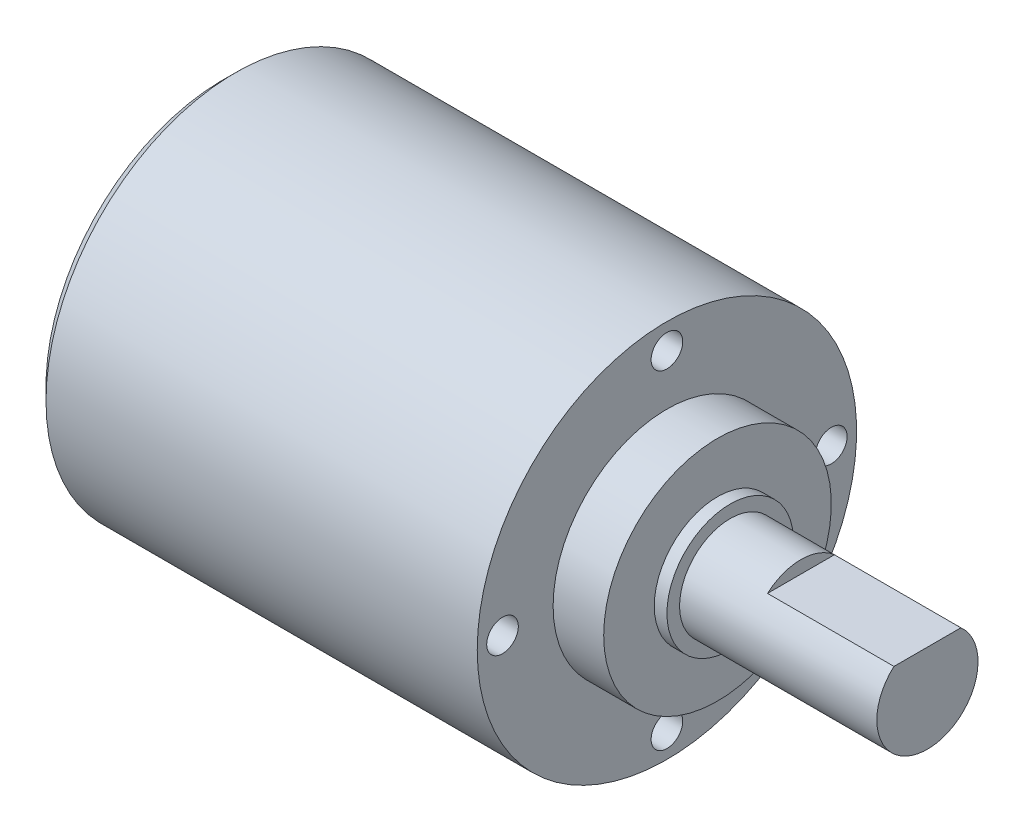
ISO-10303-21;
HEADER;
FILE_DESCRIPTION(('STEP AP214'),'2;1');
FILE_NAME('part.step','',(''),(''),'','','');
FILE_SCHEMA(('AUTOMOTIVE_DESIGN { 1 0 10303 214 1 1 1 1 }'));
ENDSEC;
DATA;
#1=APPLICATION_CONTEXT('core data for automotive mechanical design processes');
#2=APPLICATION_PROTOCOL_DEFINITION('international standard','automotive_design',2000,#1);
#3=PRODUCT_CONTEXT('',#1,'mechanical');
#4=PRODUCT('Part','Part','',(#3));
#5=PRODUCT_RELATED_PRODUCT_CATEGORY('part','',(#4));
#6=PRODUCT_DEFINITION_FORMATION('','',#4);
#7=PRODUCT_DEFINITION_CONTEXT('part definition',#1,'design');
#8=PRODUCT_DEFINITION('design','',#6,#7);
#9=PRODUCT_DEFINITION_SHAPE('','',#8);
#10=(LENGTH_UNIT() NAMED_UNIT(*) SI_UNIT(.MILLI.,.METRE.));
#11=(NAMED_UNIT(*) PLANE_ANGLE_UNIT() SI_UNIT($,.RADIAN.));
#12=(NAMED_UNIT(*) SI_UNIT($,.STERADIAN.) SOLID_ANGLE_UNIT());
#13=UNCERTAINTY_MEASURE_WITH_UNIT(LENGTH_MEASURE(1.E-05),#10,'distance_accuracy_value','');
#14=(GEOMETRIC_REPRESENTATION_CONTEXT(3) GLOBAL_UNCERTAINTY_ASSIGNED_CONTEXT((#13)) GLOBAL_UNIT_ASSIGNED_CONTEXT((#10,
#11,#12)) REPRESENTATION_CONTEXT('',''));
#15=CARTESIAN_POINT('',(0.,0.,0.));
#16=DIRECTION('',(0.,0.,1.));
#17=DIRECTION('',(1.,0.,0.));
#18=AXIS2_PLACEMENT_3D('',#15,#16,#17);
#19=CARTESIAN_POINT('',(27.85,0.,0.));
#20=DIRECTION('',(-1.,0.,0.));
#21=DIRECTION('',(0.,0.,1.));
#22=AXIS2_PLACEMENT_3D('',#19,#20,#21);
#23=PLANE('',#22);
#24=CARTESIAN_POINT('',(27.85,0.,0.));
#25=DIRECTION('',(-1.,0.,0.));
#26=DIRECTION('',(0.,0.,1.));
#27=AXIS2_PLACEMENT_3D('',#24,#25,#26);
#28=CIRCLE('',#27,4.);
#29=CARTESIAN_POINT('',(27.85,3.,-2.64575131106459));
#30=VERTEX_POINT('',#29);
#31=CARTESIAN_POINT('',(27.85,3.,2.64575131106459));
#32=VERTEX_POINT('',#31);
#33=EDGE_CURVE('E141',#30,#32,#28,.T.);
#34=ORIENTED_EDGE('',*,*,#33,.F.);
#35=DIRECTION('',(0.,0.,-1.));
#36=VECTOR('',#35,1.);
#37=CARTESIAN_POINT('',(27.85,3.,-2.64575131106459));
#38=LINE('',#37,#36);
#39=EDGE_CURVE('E115',#32,#30,#38,.T.);
#40=ORIENTED_EDGE('',*,*,#39,.F.);
#41=EDGE_LOOP('',(#34,#40));
#42=FACE_BOUND('',#41,.T.);
#43=ADVANCED_FACE('F39',(#42),#23,.F.);
#44=CARTESIAN_POINT('',(-27.85,0.,0.));
#45=DIRECTION('',(-1.,0.,0.));
#46=DIRECTION('',(0.,0.,1.));
#47=AXIS2_PLACEMENT_3D('',#44,#45,#46);
#48=CYLINDRICAL_SURFACE('',#47,4.);
#49=ORIENTED_EDGE('',*,*,#33,.T.);
#50=DIRECTION('',(1.,0.,0.));
#51=VECTOR('',#50,1.);
#52=CARTESIAN_POINT('',(17.85,3.,2.64575131106459));
#53=LINE('',#52,#51);
#54=CARTESIAN_POINT('',(17.85,3.,2.64575131106459));
#55=VERTEX_POINT('',#54);
#56=EDGE_CURVE('E68',#55,#32,#53,.T.);
#57=ORIENTED_EDGE('',*,*,#56,.F.);
#58=CARTESIAN_POINT('',(17.85,0.,0.));
#59=DIRECTION('',(1.,0.,0.));
#60=DIRECTION('',(0.,0.,-1.));
#61=AXIS2_PLACEMENT_3D('',#58,#59,#60);
#62=CIRCLE('',#61,4.);
#63=CARTESIAN_POINT('',(17.85,3.,-2.64575131106459));
#64=VERTEX_POINT('',#63);
#65=EDGE_CURVE('E58',#64,#55,#62,.T.);
#66=ORIENTED_EDGE('',*,*,#65,.F.);
#67=DIRECTION('',(1.,0.,0.));
#68=VECTOR('',#67,1.);
#69=CARTESIAN_POINT('',(17.85,3.,-2.64575131106459));
#70=LINE('',#69,#68);
#71=EDGE_CURVE('E119',#64,#30,#70,.T.);
#72=ORIENTED_EDGE('',*,*,#71,.T.);
#73=EDGE_LOOP('',(#49,#57,#66,#72));
#74=FACE_BOUND('',#73,.T.);
#75=CARTESIAN_POINT('',(12.25,0.,0.));
#76=DIRECTION('',(-1.,0.,0.));
#77=DIRECTION('',(0.,0.,1.));
#78=AXIS2_PLACEMENT_3D('',#75,#76,#77);
#79=CIRCLE('',#78,4.);
#80=CARTESIAN_POINT('',(12.25,0.,4.));
#81=VERTEX_POINT('',#80);
#82=EDGE_CURVE('E138',#81,#81,#79,.T.);
#83=ORIENTED_EDGE('',*,*,#82,.F.);
#84=EDGE_LOOP('',(#83));
#85=FACE_BOUND('',#84,.T.);
#86=ADVANCED_FACE('F156',(#74,#85),#48,.T.);
#87=CARTESIAN_POINT('',(12.25,4.,0.));
#88=DIRECTION('',(-1.,0.,0.));
#89=DIRECTION('',(0.,0.,1.));
#90=AXIS2_PLACEMENT_3D('',#87,#88,#89);
#91=PLANE('',#90);
#92=CARTESIAN_POINT('',(12.25,0.,0.));
#93=DIRECTION('',(-1.,0.,0.));
#94=DIRECTION('',(0.,0.,1.));
#95=AXIS2_PLACEMENT_3D('',#92,#93,#94);
#96=CIRCLE('',#95,5.);
#97=CARTESIAN_POINT('',(12.25,0.,5.));
#98=VERTEX_POINT('',#97);
#99=EDGE_CURVE('E135',#98,#98,#96,.T.);
#100=ORIENTED_EDGE('',*,*,#99,.F.);
#101=EDGE_LOOP('',(#100));
#102=FACE_BOUND('',#101,.T.);
#103=ORIENTED_EDGE('',*,*,#82,.T.);
#104=EDGE_LOOP('',(#103));
#105=FACE_BOUND('',#104,.T.);
#106=ADVANCED_FACE('F161',(#102,#105),#91,.F.);
#107=CARTESIAN_POINT('',(-27.85,0.,0.));
#108=DIRECTION('',(-1.,0.,0.));
#109=DIRECTION('',(0.,0.,1.));
#110=AXIS2_PLACEMENT_3D('',#107,#108,#109);
#111=CYLINDRICAL_SURFACE('',#110,5.);
#112=CARTESIAN_POINT('',(11.25,0.,0.));
#113=DIRECTION('',(-1.,0.,0.));
#114=DIRECTION('',(0.,0.,1.));
#115=AXIS2_PLACEMENT_3D('',#112,#113,#114);
#116=CIRCLE('',#115,5.);
#117=CARTESIAN_POINT('',(11.25,0.,5.));
#118=VERTEX_POINT('',#117);
#119=EDGE_CURVE('E132',#118,#118,#116,.T.);
#120=ORIENTED_EDGE('',*,*,#119,.F.);
#121=EDGE_LOOP('',(#120));
#122=FACE_BOUND('',#121,.T.);
#123=ORIENTED_EDGE('',*,*,#99,.T.);
#124=EDGE_LOOP('',(#123));
#125=FACE_BOUND('',#124,.T.);
#126=ADVANCED_FACE('F168',(#122,#125),#111,.T.);
#127=CARTESIAN_POINT('',(11.25,5.,0.));
#128=DIRECTION('',(-1.,0.,0.));
#129=DIRECTION('',(0.,0.,1.));
#130=AXIS2_PLACEMENT_3D('',#127,#128,#129);
#131=PLANE('',#130);
#132=CARTESIAN_POINT('',(11.25,0.,0.));
#133=DIRECTION('',(-1.,0.,0.));
#134=DIRECTION('',(0.,0.,1.));
#135=AXIS2_PLACEMENT_3D('',#132,#133,#134);
#136=CIRCLE('',#135,9.);
#137=CARTESIAN_POINT('',(11.25,0.,9.));
#138=VERTEX_POINT('',#137);
#139=EDGE_CURVE('E129',#138,#138,#136,.T.);
#140=ORIENTED_EDGE('',*,*,#139,.F.);
#141=EDGE_LOOP('',(#140));
#142=FACE_BOUND('',#141,.T.);
#143=ORIENTED_EDGE('',*,*,#119,.T.);
#144=EDGE_LOOP('',(#143));
#145=FACE_BOUND('',#144,.T.);
#146=ADVANCED_FACE('F172',(#142,#145),#131,.F.);
#147=CARTESIAN_POINT('',(-27.85,0.,0.));
#148=DIRECTION('',(-1.,0.,0.));
#149=DIRECTION('',(0.,0.,1.));
#150=AXIS2_PLACEMENT_3D('',#147,#148,#149);
#151=CYLINDRICAL_SURFACE('',#150,9.);
#152=CARTESIAN_POINT('',(7.24999999999999,0.,0.));
#153=DIRECTION('',(-1.,0.,0.));
#154=DIRECTION('',(0.,0.,1.));
#155=AXIS2_PLACEMENT_3D('',#152,#153,#154);
#156=CIRCLE('',#155,9.);
#157=CARTESIAN_POINT('',(7.24999999999999,0.,9.));
#158=VERTEX_POINT('',#157);
#159=EDGE_CURVE('E126',#158,#158,#156,.T.);
#160=ORIENTED_EDGE('',*,*,#159,.F.);
#161=EDGE_LOOP('',(#160));
#162=FACE_BOUND('',#161,.T.);
#163=ORIENTED_EDGE('',*,*,#139,.T.);
#164=EDGE_LOOP('',(#163));
#165=FACE_BOUND('',#164,.T.);
#166=ADVANCED_FACE('F176',(#162,#165),#151,.T.);
#167=CARTESIAN_POINT('',(7.25,9.,0.));
#168=DIRECTION('',(-1.,0.,0.));
#169=DIRECTION('',(0.,0.,1.));
#170=AXIS2_PLACEMENT_3D('',#167,#168,#169);
#171=PLANE('',#170);
#172=CARTESIAN_POINT('',(7.25,1.35723916618575E-13,13.));
#173=DIRECTION('',(1.,0.,0.));
#174=DIRECTION('',(0.,0.,-1.));
#175=AXIS2_PLACEMENT_3D('',#172,#173,#174);
#176=CIRCLE('',#175,1.25);
#177=CARTESIAN_POINT('',(7.25,1.35723916618575E-13,11.75));
#178=VERTEX_POINT('',#177);
#179=EDGE_CURVE('E93',#178,#178,#176,.T.);
#180=ORIENTED_EDGE('',*,*,#179,.F.);
#181=EDGE_LOOP('',(#180));
#182=FACE_BOUND('',#181,.T.);
#183=CARTESIAN_POINT('',(7.25,-13.,0.));
#184=DIRECTION('',(1.,0.,0.));
#185=DIRECTION('',(0.,0.,-1.));
#186=AXIS2_PLACEMENT_3D('',#183,#184,#185);
#187=CIRCLE('',#186,1.25);
#188=CARTESIAN_POINT('',(7.25,-13.,-1.24999999999991));
#189=VERTEX_POINT('',#188);
#190=EDGE_CURVE('E92',#189,#189,#187,.T.);
#191=ORIENTED_EDGE('',*,*,#190,.F.);
#192=EDGE_LOOP('',(#191));
#193=FACE_BOUND('',#192,.T.);
#194=CARTESIAN_POINT('',(7.25,0.,-13.));
#195=DIRECTION('',(1.,0.,0.));
#196=DIRECTION('',(0.,0.,-1.));
#197=AXIS2_PLACEMENT_3D('',#194,#195,#196);
#198=CIRCLE('',#197,1.25);
#199=CARTESIAN_POINT('',(7.25,0.,-14.25));
#200=VERTEX_POINT('',#199);
#201=EDGE_CURVE('E103',#200,#200,#198,.T.);
#202=ORIENTED_EDGE('',*,*,#201,.F.);
#203=EDGE_LOOP('',(#202));
#204=FACE_BOUND('',#203,.T.);
#205=CARTESIAN_POINT('',(7.25,13.,0.));
#206=DIRECTION('',(1.,0.,0.));
#207=DIRECTION('',(0.,0.,-1.));
#208=AXIS2_PLACEMENT_3D('',#205,#206,#207);
#209=CIRCLE('',#208,1.25);
#210=CARTESIAN_POINT('',(7.25,13.,-1.25));
#211=VERTEX_POINT('',#210);
#212=EDGE_CURVE('E109',#211,#211,#209,.T.);
#213=ORIENTED_EDGE('',*,*,#212,.F.);
#214=EDGE_LOOP('',(#213));
#215=FACE_BOUND('',#214,.T.);
#216=CARTESIAN_POINT('',(7.24999999999999,0.,0.));
#217=DIRECTION('',(-1.,0.,0.));
#218=DIRECTION('',(0.,0.,1.));
#219=AXIS2_PLACEMENT_3D('',#216,#217,#218);
#220=CIRCLE('',#219,15.);
#221=CARTESIAN_POINT('',(7.24999999999999,0.,15.));
#222=VERTEX_POINT('',#221);
#223=EDGE_CURVE('E122',#222,#222,#220,.T.);
#224=ORIENTED_EDGE('',*,*,#223,.F.);
#225=EDGE_LOOP('',(#224));
#226=FACE_BOUND('',#225,.T.);
#227=ORIENTED_EDGE('',*,*,#159,.T.);
#228=EDGE_LOOP('',(#227));
#229=FACE_BOUND('',#228,.T.);
#230=ADVANCED_FACE('F180',(#182,#193,#204,#215,#226,#229),#171,.F.);
#231=CARTESIAN_POINT('',(-27.85,0.,0.));
#232=DIRECTION('',(-1.,0.,0.));
#233=DIRECTION('',(0.,0.,1.));
#234=AXIS2_PLACEMENT_3D('',#231,#232,#233);
#235=CYLINDRICAL_SURFACE('',#234,15.);
#236=CARTESIAN_POINT('',(-26.85,0.,0.));
#237=DIRECTION('',(1.,0.,0.));
#238=DIRECTION('',(0.,0.,-1.));
#239=AXIS2_PLACEMENT_3D('',#236,#237,#238);
#240=CIRCLE('',#239,15.);
#241=CARTESIAN_POINT('',(-26.85,0.,-15.));
#242=VERTEX_POINT('',#241);
#243=EDGE_CURVE('E11',#242,#242,#240,.T.);
#244=ORIENTED_EDGE('',*,*,#243,.T.);
#245=EDGE_LOOP('',(#244));
#246=FACE_BOUND('',#245,.T.);
#247=ORIENTED_EDGE('',*,*,#223,.T.);
#248=EDGE_LOOP('',(#247));
#249=FACE_BOUND('',#248,.T.);
#250=ADVANCED_FACE('F184',(#246,#249),#235,.T.);
#251=CARTESIAN_POINT('',(-27.85,15.,0.));
#252=DIRECTION('',(1.,0.,0.));
#253=DIRECTION('',(0.,0.,-1.));
#254=AXIS2_PLACEMENT_3D('',#251,#252,#253);
#255=PLANE('',#254);
#256=CARTESIAN_POINT('',(-27.85,0.,0.));
#257=DIRECTION('',(1.,0.,0.));
#258=DIRECTION('',(0.,0.,-1.));
#259=AXIS2_PLACEMENT_3D('',#256,#257,#258);
#260=CIRCLE('',#259,14.);
#261=CARTESIAN_POINT('',(-27.85,0.,-14.));
#262=VERTEX_POINT('',#261);
#263=EDGE_CURVE('E47',#262,#262,#260,.F.);
#264=ORIENTED_EDGE('',*,*,#263,.T.);
#265=EDGE_LOOP('',(#264));
#266=FACE_BOUND('',#265,.T.);
#267=ADVANCED_FACE('F146',(#266),#255,.F.);
#268=CARTESIAN_POINT('',(17.85,3.,-2.64575131106459));
#269=DIRECTION('',(0.,-1.,0.));
#270=DIRECTION('',(0.,0.,-1.));
#271=AXIS2_PLACEMENT_3D('',#268,#269,#270);
#272=PLANE('',#271);
#273=ORIENTED_EDGE('',*,*,#39,.T.);
#274=ORIENTED_EDGE('',*,*,#71,.F.);
#275=DIRECTION('',(0.,0.,-1.));
#276=VECTOR('',#275,1.);
#277=CARTESIAN_POINT('',(17.85,3.,-2.64575131106459));
#278=LINE('',#277,#276);
#279=EDGE_CURVE('E53',#55,#64,#278,.T.);
#280=ORIENTED_EDGE('',*,*,#279,.F.);
#281=ORIENTED_EDGE('',*,*,#56,.T.);
#282=EDGE_LOOP('',(#273,#274,#280,#281));
#283=FACE_BOUND('',#282,.T.);
#284=ADVANCED_FACE('F191',(#283),#272,.F.);
#285=CARTESIAN_POINT('',(17.85,0.,0.));
#286=DIRECTION('',(1.,0.,0.));
#287=DIRECTION('',(0.,0.,-1.));
#288=AXIS2_PLACEMENT_3D('',#285,#286,#287);
#289=PLANE('',#288);
#290=ORIENTED_EDGE('',*,*,#65,.T.);
#291=ORIENTED_EDGE('',*,*,#279,.T.);
#292=EDGE_LOOP('',(#290,#291));
#293=FACE_BOUND('',#292,.T.);
#294=ADVANCED_FACE('F194',(#293),#289,.T.);
#295=CARTESIAN_POINT('',(1.75,13.,0.));
#296=DIRECTION('',(1.,0.,0.));
#297=DIRECTION('',(0.,0.,-1.));
#298=AXIS2_PLACEMENT_3D('',#295,#296,#297);
#299=CONICAL_SURFACE('',#298,1.25,1.02974425867665);
#300=CARTESIAN_POINT('',(0.998924226215546,13.,0.));
#301=VERTEX_POINT('',#300);
#302=VERTEX_LOOP('',#301);
#303=FACE_BOUND('',#302,.T.);
#304=CARTESIAN_POINT('',(1.75,13.,0.));
#305=DIRECTION('',(1.,0.,0.));
#306=DIRECTION('',(0.,0.,-1.));
#307=AXIS2_PLACEMENT_3D('',#304,#305,#306);
#308=CIRCLE('',#307,1.25);
#309=CARTESIAN_POINT('',(1.75,13.,-1.25));
#310=VERTEX_POINT('',#309);
#311=EDGE_CURVE('E112',#310,#310,#308,.T.);
#312=ORIENTED_EDGE('',*,*,#311,.T.);
#313=EDGE_LOOP('',(#312));
#314=FACE_BOUND('',#313,.T.);
#315=ADVANCED_FACE('F197',(#303,#314),#299,.F.);
#316=CARTESIAN_POINT('',(7.25,13.,0.));
#317=DIRECTION('',(1.,0.,0.));
#318=DIRECTION('',(0.,0.,-1.));
#319=AXIS2_PLACEMENT_3D('',#316,#317,#318);
#320=CYLINDRICAL_SURFACE('',#319,1.25);
#321=ORIENTED_EDGE('',*,*,#311,.F.);
#322=EDGE_LOOP('',(#321));
#323=FACE_BOUND('',#322,.T.);
#324=ORIENTED_EDGE('',*,*,#212,.T.);
#325=EDGE_LOOP('',(#324));
#326=FACE_BOUND('',#325,.T.);
#327=ADVANCED_FACE('F200',(#323,#326),#320,.F.);
#328=CARTESIAN_POINT('',(1.75,0.,-13.));
#329=DIRECTION('',(1.,0.,0.));
#330=DIRECTION('',(0.,0.,-1.));
#331=AXIS2_PLACEMENT_3D('',#328,#329,#330);
#332=CONICAL_SURFACE('',#331,1.25,1.02974425867665);
#333=CARTESIAN_POINT('',(0.998924226215546,0.,-13.));
#334=VERTEX_POINT('',#333);
#335=VERTEX_LOOP('',#334);
#336=FACE_BOUND('',#335,.T.);
#337=CARTESIAN_POINT('',(1.75,0.,-13.));
#338=DIRECTION('',(1.,0.,0.));
#339=DIRECTION('',(0.,0.,-1.));
#340=AXIS2_PLACEMENT_3D('',#337,#338,#339);
#341=CIRCLE('',#340,1.25);
#342=CARTESIAN_POINT('',(1.75,0.,-14.25));
#343=VERTEX_POINT('',#342);
#344=EDGE_CURVE('E106',#343,#343,#341,.T.);
#345=ORIENTED_EDGE('',*,*,#344,.T.);
#346=EDGE_LOOP('',(#345));
#347=FACE_BOUND('',#346,.T.);
#348=ADVANCED_FACE('F203',(#336,#347),#332,.F.);
#349=CARTESIAN_POINT('',(7.25,0.,-13.));
#350=DIRECTION('',(1.,0.,0.));
#351=DIRECTION('',(0.,0.,-1.));
#352=AXIS2_PLACEMENT_3D('',#349,#350,#351);
#353=CYLINDRICAL_SURFACE('',#352,1.25);
#354=ORIENTED_EDGE('',*,*,#344,.F.);
#355=EDGE_LOOP('',(#354));
#356=FACE_BOUND('',#355,.T.);
#357=ORIENTED_EDGE('',*,*,#201,.T.);
#358=EDGE_LOOP('',(#357));
#359=FACE_BOUND('',#358,.T.);
#360=ADVANCED_FACE('F207',(#356,#359),#353,.F.);
#361=CARTESIAN_POINT('',(1.75,-13.,0.));
#362=DIRECTION('',(1.,0.,0.));
#363=DIRECTION('',(0.,0.,-1.));
#364=AXIS2_PLACEMENT_3D('',#361,#362,#363);
#365=CONICAL_SURFACE('',#364,1.25,1.02974425867665);
#366=CARTESIAN_POINT('',(0.998924226215546,-13.,0.));
#367=VERTEX_POINT('',#366);
#368=VERTEX_LOOP('',#367);
#369=FACE_BOUND('',#368,.T.);
#370=CARTESIAN_POINT('',(1.75,-13.,0.));
#371=DIRECTION('',(1.,0.,0.));
#372=DIRECTION('',(0.,0.,-1.));
#373=AXIS2_PLACEMENT_3D('',#370,#371,#372);
#374=CIRCLE('',#373,1.25);
#375=CARTESIAN_POINT('',(1.75,-13.,-1.24999999999991));
#376=VERTEX_POINT('',#375);
#377=EDGE_CURVE('E96',#376,#376,#374,.T.);
#378=ORIENTED_EDGE('',*,*,#377,.T.);
#379=EDGE_LOOP('',(#378));
#380=FACE_BOUND('',#379,.T.);
#381=ADVANCED_FACE('F210',(#369,#380),#365,.F.);
#382=CARTESIAN_POINT('',(7.25,-13.,0.));
#383=DIRECTION('',(1.,0.,0.));
#384=DIRECTION('',(0.,0.,-1.));
#385=AXIS2_PLACEMENT_3D('',#382,#383,#384);
#386=CYLINDRICAL_SURFACE('',#385,1.25);
#387=ORIENTED_EDGE('',*,*,#377,.F.);
#388=EDGE_LOOP('',(#387));
#389=FACE_BOUND('',#388,.T.);
#390=ORIENTED_EDGE('',*,*,#190,.T.);
#391=EDGE_LOOP('',(#390));
#392=FACE_BOUND('',#391,.T.);
#393=ADVANCED_FACE('F86',(#389,#392),#386,.F.);
#394=CARTESIAN_POINT('',(1.75,1.35723916618575E-13,13.));
#395=DIRECTION('',(1.,0.,0.));
#396=DIRECTION('',(0.,0.,-1.));
#397=AXIS2_PLACEMENT_3D('',#394,#395,#396);
#398=CONICAL_SURFACE('',#397,1.25,1.02974425867665);
#399=CARTESIAN_POINT('',(0.998924226215546,1.34192844631056E-13,13.));
#400=VERTEX_POINT('',#399);
#401=VERTEX_LOOP('',#400);
#402=FACE_BOUND('',#401,.T.);
#403=CARTESIAN_POINT('',(1.75,1.35723916618575E-13,13.));
#404=DIRECTION('',(1.,0.,0.));
#405=DIRECTION('',(0.,0.,-1.));
#406=AXIS2_PLACEMENT_3D('',#403,#404,#405);
#407=CIRCLE('',#406,1.25);
#408=CARTESIAN_POINT('',(1.75,1.35723916618575E-13,11.75));
#409=VERTEX_POINT('',#408);
#410=EDGE_CURVE('E90',#409,#409,#407,.T.);
#411=ORIENTED_EDGE('',*,*,#410,.T.);
#412=EDGE_LOOP('',(#411));
#413=FACE_BOUND('',#412,.T.);
#414=ADVANCED_FACE('F82',(#402,#413),#398,.F.);
#415=CARTESIAN_POINT('',(7.25,1.35723916618575E-13,13.));
#416=DIRECTION('',(1.,0.,0.));
#417=DIRECTION('',(0.,0.,-1.));
#418=AXIS2_PLACEMENT_3D('',#415,#416,#417);
#419=CYLINDRICAL_SURFACE('',#418,1.25);
#420=ORIENTED_EDGE('',*,*,#410,.F.);
#421=EDGE_LOOP('',(#420));
#422=FACE_BOUND('',#421,.T.);
#423=ORIENTED_EDGE('',*,*,#179,.T.);
#424=EDGE_LOOP('',(#423));
#425=FACE_BOUND('',#424,.T.);
#426=ADVANCED_FACE('F85',(#422,#425),#419,.F.);
#427=CARTESIAN_POINT('',(-27.85,0.,0.));
#428=DIRECTION('',(1.,0.,0.));
#429=DIRECTION('',(0.,0.,-1.));
#430=AXIS2_PLACEMENT_3D('',#427,#428,#429);
#431=CONICAL_SURFACE('',#430,14.,0.785398163397447);
#432=ORIENTED_EDGE('',*,*,#243,.F.);
#433=EDGE_LOOP('',(#432));
#434=FACE_BOUND('',#433,.T.);
#435=ORIENTED_EDGE('',*,*,#263,.F.);
#436=EDGE_LOOP('',(#435));
#437=FACE_BOUND('',#436,.T.);
#438=ADVANCED_FACE('F41',(#434,#437),#431,.T.);
#439=CLOSED_SHELL('',(#43,#86,#106,#126,#146,#166,#230,#250,#267,#284,#294,#315,#327,#348,#360,
#381,#393,#414,#426,#438));
#440=MANIFOLD_SOLID_BREP('B2',#439);
#441=ADVANCED_BREP_SHAPE_REPRESENTATION('',(#18,#440),#14);
#442=SHAPE_DEFINITION_REPRESENTATION(#9,#441);
ENDSEC;
END-ISO-10303-21;
